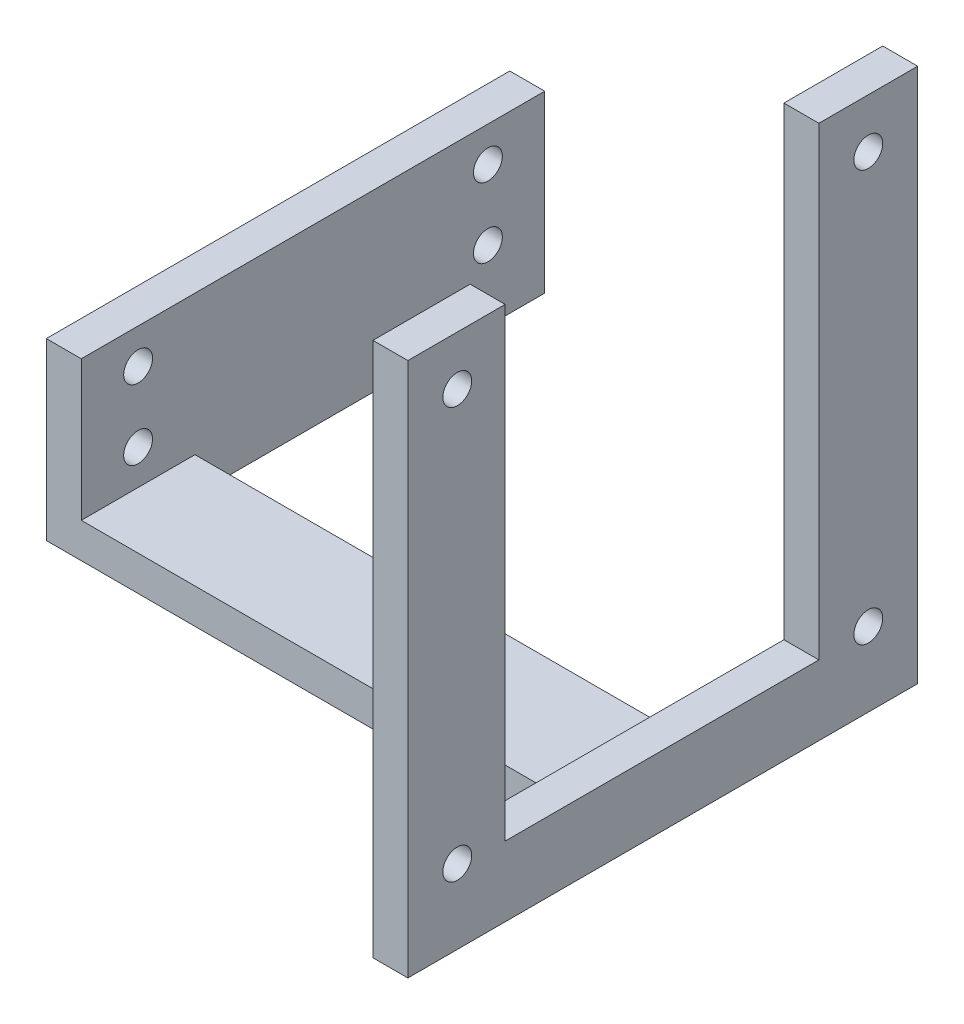
ISO-10303-21;
HEADER;
FILE_DESCRIPTION(('STEP AP214'),'2;1');
FILE_NAME('part.step','',(''),(''),'','','');
FILE_SCHEMA(('AUTOMOTIVE_DESIGN { 1 0 10303 214 1 1 1 1 }'));
ENDSEC;
DATA;
#1=APPLICATION_CONTEXT('core data for automotive mechanical design processes');
#2=APPLICATION_PROTOCOL_DEFINITION('international standard','automotive_design',2000,#1);
#3=PRODUCT_CONTEXT('',#1,'mechanical');
#4=PRODUCT('Part','Part','',(#3));
#5=PRODUCT_RELATED_PRODUCT_CATEGORY('part','',(#4));
#6=PRODUCT_DEFINITION_FORMATION('','',#4);
#7=PRODUCT_DEFINITION_CONTEXT('part definition',#1,'design');
#8=PRODUCT_DEFINITION('design','',#6,#7);
#9=PRODUCT_DEFINITION_SHAPE('','',#8);
#10=(LENGTH_UNIT() NAMED_UNIT(*) SI_UNIT(.MILLI.,.METRE.));
#11=(NAMED_UNIT(*) PLANE_ANGLE_UNIT() SI_UNIT($,.RADIAN.));
#12=(NAMED_UNIT(*) SI_UNIT($,.STERADIAN.) SOLID_ANGLE_UNIT());
#13=UNCERTAINTY_MEASURE_WITH_UNIT(LENGTH_MEASURE(1.E-05),#10,'distance_accuracy_value','');
#14=(GEOMETRIC_REPRESENTATION_CONTEXT(3) GLOBAL_UNCERTAINTY_ASSIGNED_CONTEXT((#13)) GLOBAL_UNIT_ASSIGNED_CONTEXT((#10,
#11,#12)) REPRESENTATION_CONTEXT('',''));
#15=CARTESIAN_POINT('',(0.,0.,0.));
#16=DIRECTION('',(0.,0.,1.));
#17=DIRECTION('',(1.,0.,0.));
#18=AXIS2_PLACEMENT_3D('',#15,#16,#17);
#19=CARTESIAN_POINT('',(4.,0.,-13.));
#20=DIRECTION('',(0.,0.,1.));
#21=DIRECTION('',(0.,-1.,0.));
#22=AXIS2_PLACEMENT_3D('',#19,#20,#21);
#23=PLANE('',#22);
#24=DIRECTION('',(0.,-1.,0.));
#25=VECTOR('',#24,1.);
#26=CARTESIAN_POINT('',(4.,-20.,-13.));
#27=LINE('',#26,#25);
#28=CARTESIAN_POINT('',(4.,-16.,-13.));
#29=VERTEX_POINT('',#28);
#30=CARTESIAN_POINT('',(4.,-20.,-13.));
#31=VERTEX_POINT('',#30);
#32=EDGE_CURVE('E165',#29,#31,#27,.T.);
#33=ORIENTED_EDGE('',*,*,#32,.F.);
#34=DIRECTION('',(-1.,0.,0.));
#35=VECTOR('',#34,1.);
#36=CARTESIAN_POINT('',(64.,-16.,-13.));
#37=LINE('',#36,#35);
#38=CARTESIAN_POINT('',(60.,-16.,-13.));
#39=VERTEX_POINT('',#38);
#40=EDGE_CURVE('E266',#39,#29,#37,.T.);
#41=ORIENTED_EDGE('',*,*,#40,.F.);
#42=DIRECTION('',(0.,1.,0.));
#43=VECTOR('',#42,1.);
#44=CARTESIAN_POINT('',(60.,0.,-13.));
#45=LINE('',#44,#43);
#46=CARTESIAN_POINT('',(60.,-20.,-13.));
#47=VERTEX_POINT('',#46);
#48=EDGE_CURVE('E183',#47,#39,#45,.T.);
#49=ORIENTED_EDGE('',*,*,#48,.F.);
#50=DIRECTION('',(1.,0.,0.));
#51=VECTOR('',#50,1.);
#52=CARTESIAN_POINT('',(4.,-20.,-13.));
#53=LINE('',#52,#51);
#54=EDGE_CURVE('E273',#31,#47,#53,.T.);
#55=ORIENTED_EDGE('',*,*,#54,.F.);
#56=EDGE_LOOP('',(#33,#41,#49,#55));
#57=FACE_BOUND('',#56,.T.);
#58=ADVANCED_FACE('F35',(#57),#23,.F.);
#59=CARTESIAN_POINT('',(4.,0.,0.));
#60=DIRECTION('',(0.,0.,-1.));
#61=DIRECTION('',(0.,1.,0.));
#62=AXIS2_PLACEMENT_3D('',#59,#60,#61);
#63=PLANE('',#62);
#64=DIRECTION('',(0.,-1.,0.));
#65=VECTOR('',#64,1.);
#66=CARTESIAN_POINT('',(60.,0.,0.));
#67=LINE('',#66,#65);
#68=CARTESIAN_POINT('',(60.,-16.,0.));
#69=VERTEX_POINT('',#68);
#70=CARTESIAN_POINT('',(60.,-20.,0.));
#71=VERTEX_POINT('',#70);
#72=EDGE_CURVE('E187',#69,#71,#67,.T.);
#73=ORIENTED_EDGE('',*,*,#72,.F.);
#74=DIRECTION('',(-1.,0.,0.));
#75=VECTOR('',#74,1.);
#76=CARTESIAN_POINT('',(64.,-16.,0.));
#77=LINE('',#76,#75);
#78=CARTESIAN_POINT('',(4.,-16.,0.));
#79=VERTEX_POINT('',#78);
#80=EDGE_CURVE('E262',#69,#79,#77,.T.);
#81=ORIENTED_EDGE('',*,*,#80,.T.);
#82=DIRECTION('',(0.,-1.,0.));
#83=VECTOR('',#82,1.);
#84=CARTESIAN_POINT('',(4.,0.,0.));
#85=LINE('',#84,#83);
#86=CARTESIAN_POINT('',(4.,0.,0.));
#87=VERTEX_POINT('',#86);
#88=EDGE_CURVE('E154',#87,#79,#85,.T.);
#89=ORIENTED_EDGE('',*,*,#88,.F.);
#90=DIRECTION('',(-1.,0.,0.));
#91=VECTOR('',#90,1.);
#92=CARTESIAN_POINT('',(4.,0.,0.));
#93=LINE('',#92,#91);
#94=CARTESIAN_POINT('',(0.,0.,0.));
#95=VERTEX_POINT('',#94);
#96=EDGE_CURVE('E11',#87,#95,#93,.T.);
#97=ORIENTED_EDGE('',*,*,#96,.T.);
#98=DIRECTION('',(0.,-1.,0.));
#99=VECTOR('',#98,1.);
#100=CARTESIAN_POINT('',(0.,0.,0.));
#101=LINE('',#100,#99);
#102=CARTESIAN_POINT('',(0.,-20.,0.));
#103=VERTEX_POINT('',#102);
#104=EDGE_CURVE('E152',#95,#103,#101,.T.);
#105=ORIENTED_EDGE('',*,*,#104,.T.);
#106=DIRECTION('',(-1.,0.,0.));
#107=VECTOR('',#106,1.);
#108=CARTESIAN_POINT('',(4.,-20.,0.));
#109=LINE('',#108,#107);
#110=EDGE_CURVE('E269',#71,#103,#109,.T.);
#111=ORIENTED_EDGE('',*,*,#110,.F.);
#112=EDGE_LOOP('',(#73,#81,#89,#97,#105,#111));
#113=FACE_BOUND('',#112,.T.);
#114=ADVANCED_FACE('F37',(#113),#63,.F.);
#115=CARTESIAN_POINT('',(64.,-16.,0.));
#116=DIRECTION('',(0.,-1.,0.));
#117=DIRECTION('',(0.,0.,-1.));
#118=AXIS2_PLACEMENT_3D('',#115,#116,#117);
#119=PLANE('',#118);
#120=DIRECTION('',(0.,0.,1.));
#121=VECTOR('',#120,1.);
#122=CARTESIAN_POINT('',(60.,-16.,0.));
#123=LINE('',#122,#121);
#124=EDGE_CURVE('E256',#39,#69,#123,.T.);
#125=ORIENTED_EDGE('',*,*,#124,.F.);
#126=ORIENTED_EDGE('',*,*,#40,.T.);
#127=DIRECTION('',(0.,0.,1.));
#128=VECTOR('',#127,1.);
#129=CARTESIAN_POINT('',(4.,-16.,0.));
#130=LINE('',#129,#128);
#131=EDGE_CURVE('E259',#29,#79,#130,.T.);
#132=ORIENTED_EDGE('',*,*,#131,.T.);
#133=ORIENTED_EDGE('',*,*,#80,.F.);
#134=EDGE_LOOP('',(#125,#126,#132,#133));
#135=FACE_BOUND('',#134,.T.);
#136=ADVANCED_FACE('F321',(#135),#119,.F.);
#137=CARTESIAN_POINT('',(4.,0.,0.));
#138=DIRECTION('',(0.,-1.,0.));
#139=DIRECTION('',(0.,0.,-1.));
#140=AXIS2_PLACEMENT_3D('',#137,#138,#139);
#141=PLANE('',#140);
#142=DIRECTION('',(0.,0.,1.));
#143=VECTOR('',#142,1.);
#144=CARTESIAN_POINT('',(0.,0.,0.));
#145=LINE('',#144,#143);
#146=CARTESIAN_POINT('',(0.,0.,-53.));
#147=VERTEX_POINT('',#146);
#148=EDGE_CURVE('E145',#147,#95,#145,.T.);
#149=ORIENTED_EDGE('',*,*,#148,.T.);
#150=ORIENTED_EDGE('',*,*,#96,.F.);
#151=DIRECTION('',(0.,0.,1.));
#152=VECTOR('',#151,1.);
#153=CARTESIAN_POINT('',(4.,0.,0.));
#154=LINE('',#153,#152);
#155=CARTESIAN_POINT('',(4.,0.,-53.));
#156=VERTEX_POINT('',#155);
#157=EDGE_CURVE('E44',#156,#87,#154,.T.);
#158=ORIENTED_EDGE('',*,*,#157,.F.);
#159=DIRECTION('',(1.,0.,0.));
#160=VECTOR('',#159,1.);
#161=CARTESIAN_POINT('',(0.,0.,-53.));
#162=LINE('',#161,#160);
#163=EDGE_CURVE('E157',#147,#156,#162,.T.);
#164=ORIENTED_EDGE('',*,*,#163,.F.);
#165=EDGE_LOOP('',(#149,#150,#158,#164));
#166=FACE_BOUND('',#165,.T.);
#167=ADVANCED_FACE('F158',(#166),#141,.F.);
#168=CARTESIAN_POINT('',(4.,0.,0.));
#169=DIRECTION('',(1.,0.,0.));
#170=DIRECTION('',(0.,0.,-1.));
#171=AXIS2_PLACEMENT_3D('',#168,#169,#170);
#172=PLANE('',#171);
#173=CARTESIAN_POINT('',(4.,-12.,-46.5));
#174=DIRECTION('',(1.,0.,0.));
#175=DIRECTION('',(0.,0.,-1.));
#176=AXIS2_PLACEMENT_3D('',#173,#174,#175);
#177=CIRCLE('',#176,1.65);
#178=CARTESIAN_POINT('',(4.,-12.,-48.15));
#179=VERTEX_POINT('',#178);
#180=EDGE_CURVE('E701',#179,#179,#177,.T.);
#181=ORIENTED_EDGE('',*,*,#180,.F.);
#182=EDGE_LOOP('',(#181));
#183=FACE_BOUND('',#182,.T.);
#184=CARTESIAN_POINT('',(4.,-4.,-46.5));
#185=DIRECTION('',(1.,0.,0.));
#186=DIRECTION('',(0.,0.,-1.));
#187=AXIS2_PLACEMENT_3D('',#184,#185,#186);
#188=CIRCLE('',#187,1.65);
#189=CARTESIAN_POINT('',(4.,-4.,-48.15));
#190=VERTEX_POINT('',#189);
#191=EDGE_CURVE('E167',#190,#190,#188,.T.);
#192=ORIENTED_EDGE('',*,*,#191,.F.);
#193=EDGE_LOOP('',(#192));
#194=FACE_BOUND('',#193,.T.);
#195=ORIENTED_EDGE('',*,*,#131,.F.);
#196=ORIENTED_EDGE('',*,*,#32,.T.);
#197=DIRECTION('',(0.,0.,1.));
#198=VECTOR('',#197,1.);
#199=CARTESIAN_POINT('',(4.,-20.,-53.));
#200=LINE('',#199,#198);
#201=CARTESIAN_POINT('',(4.,-20.,-53.));
#202=VERTEX_POINT('',#201);
#203=EDGE_CURVE('E52',#202,#31,#200,.T.);
#204=ORIENTED_EDGE('',*,*,#203,.F.);
#205=DIRECTION('',(0.,-1.,0.));
#206=VECTOR('',#205,1.);
#207=CARTESIAN_POINT('',(4.,-20.,-53.));
#208=LINE('',#207,#206);
#209=EDGE_CURVE('E160',#156,#202,#208,.T.);
#210=ORIENTED_EDGE('',*,*,#209,.F.);
#211=ORIENTED_EDGE('',*,*,#157,.T.);
#212=ORIENTED_EDGE('',*,*,#88,.T.);
#213=EDGE_LOOP('',(#195,#196,#204,#210,#211,#212));
#214=FACE_BOUND('',#213,.T.);
#215=CARTESIAN_POINT('',(4.,-12.,-6.5));
#216=DIRECTION('',(1.,0.,0.));
#217=DIRECTION('',(0.,0.,-1.));
#218=AXIS2_PLACEMENT_3D('',#215,#216,#217);
#219=CIRCLE('',#218,1.65);
#220=CARTESIAN_POINT('',(4.,-12.,-8.15));
#221=VERTEX_POINT('',#220);
#222=EDGE_CURVE('E275',#221,#221,#219,.T.);
#223=ORIENTED_EDGE('',*,*,#222,.F.);
#224=EDGE_LOOP('',(#223));
#225=FACE_BOUND('',#224,.T.);
#226=CARTESIAN_POINT('',(4.,-4.,-6.5));
#227=DIRECTION('',(1.,0.,0.));
#228=DIRECTION('',(0.,0.,-1.));
#229=AXIS2_PLACEMENT_3D('',#226,#227,#228);
#230=CIRCLE('',#229,1.65);
#231=CARTESIAN_POINT('',(4.,-4.,-8.15));
#232=VERTEX_POINT('',#231);
#233=EDGE_CURVE('E279',#232,#232,#230,.T.);
#234=ORIENTED_EDGE('',*,*,#233,.F.);
#235=EDGE_LOOP('',(#234));
#236=FACE_BOUND('',#235,.T.);
#237=ADVANCED_FACE('F326',(#183,#194,#214,#225,#236),#172,.T.);
#238=CARTESIAN_POINT('',(0.,0.,0.));
#239=DIRECTION('',(1.,0.,0.));
#240=DIRECTION('',(0.,0.,-1.));
#241=AXIS2_PLACEMENT_3D('',#238,#239,#240);
#242=PLANE('',#241);
#243=CARTESIAN_POINT('',(0.,-12.,-46.5));
#244=DIRECTION('',(-1.,0.,0.));
#245=DIRECTION('',(0.,0.,1.));
#246=AXIS2_PLACEMENT_3D('',#243,#244,#245);
#247=CIRCLE('',#246,1.65);
#248=CARTESIAN_POINT('',(0.,-12.,-44.85));
#249=VERTEX_POINT('',#248);
#250=EDGE_CURVE('E704',#249,#249,#247,.T.);
#251=ORIENTED_EDGE('',*,*,#250,.F.);
#252=EDGE_LOOP('',(#251));
#253=FACE_BOUND('',#252,.T.);
#254=CARTESIAN_POINT('',(0.,-4.,-46.5));
#255=DIRECTION('',(-1.,0.,0.));
#256=DIRECTION('',(0.,0.,1.));
#257=AXIS2_PLACEMENT_3D('',#254,#255,#256);
#258=CIRCLE('',#257,1.65);
#259=CARTESIAN_POINT('',(0.,-4.,-44.85));
#260=VERTEX_POINT('',#259);
#261=EDGE_CURVE('E706',#260,#260,#258,.T.);
#262=ORIENTED_EDGE('',*,*,#261,.F.);
#263=EDGE_LOOP('',(#262));
#264=FACE_BOUND('',#263,.T.);
#265=CARTESIAN_POINT('',(0.,-12.,-6.5));
#266=DIRECTION('',(1.,0.,0.));
#267=DIRECTION('',(0.,0.,-1.));
#268=AXIS2_PLACEMENT_3D('',#265,#266,#267);
#269=CIRCLE('',#268,1.65);
#270=CARTESIAN_POINT('',(0.,-12.,-8.15));
#271=VERTEX_POINT('',#270);
#272=EDGE_CURVE('E278',#271,#271,#269,.T.);
#273=ORIENTED_EDGE('',*,*,#272,.T.);
#274=EDGE_LOOP('',(#273));
#275=FACE_BOUND('',#274,.T.);
#276=CARTESIAN_POINT('',(0.,-4.,-6.5));
#277=DIRECTION('',(1.,0.,0.));
#278=DIRECTION('',(0.,0.,-1.));
#279=AXIS2_PLACEMENT_3D('',#276,#277,#278);
#280=CIRCLE('',#279,1.65);
#281=CARTESIAN_POINT('',(0.,-4.,-8.15));
#282=VERTEX_POINT('',#281);
#283=EDGE_CURVE('E282',#282,#282,#280,.T.);
#284=ORIENTED_EDGE('',*,*,#283,.T.);
#285=EDGE_LOOP('',(#284));
#286=FACE_BOUND('',#285,.T.);
#287=ORIENTED_EDGE('',*,*,#104,.F.);
#288=ORIENTED_EDGE('',*,*,#148,.F.);
#289=DIRECTION('',(0.,1.,0.));
#290=VECTOR('',#289,1.);
#291=CARTESIAN_POINT('',(0.,-20.,-53.));
#292=LINE('',#291,#290);
#293=CARTESIAN_POINT('',(0.,-20.,-53.));
#294=VERTEX_POINT('',#293);
#295=EDGE_CURVE('E150',#294,#147,#292,.T.);
#296=ORIENTED_EDGE('',*,*,#295,.F.);
#297=DIRECTION('',(0.,0.,-1.));
#298=VECTOR('',#297,1.);
#299=CARTESIAN_POINT('',(0.,-20.,0.));
#300=LINE('',#299,#298);
#301=EDGE_CURVE('E271',#103,#294,#300,.T.);
#302=ORIENTED_EDGE('',*,*,#301,.F.);
#303=EDGE_LOOP('',(#287,#288,#296,#302));
#304=FACE_BOUND('',#303,.T.);
#305=ADVANCED_FACE('F147',(#253,#264,#275,#286,#304),#242,.F.);
#306=CARTESIAN_POINT('',(-6.,-4.,-6.5));
#307=DIRECTION('',(1.,0.,0.));
#308=DIRECTION('',(0.,0.,-1.));
#309=AXIS2_PLACEMENT_3D('',#306,#307,#308);
#310=CYLINDRICAL_SURFACE('',#309,1.65);
#311=ORIENTED_EDGE('',*,*,#233,.T.);
#312=EDGE_LOOP('',(#311));
#313=FACE_BOUND('',#312,.T.);
#314=ORIENTED_EDGE('',*,*,#283,.F.);
#315=EDGE_LOOP('',(#314));
#316=FACE_BOUND('',#315,.T.);
#317=ADVANCED_FACE('F329',(#313,#316),#310,.F.);
#318=CARTESIAN_POINT('',(-6.,-12.,-6.5));
#319=DIRECTION('',(1.,0.,0.));
#320=DIRECTION('',(0.,0.,-1.));
#321=AXIS2_PLACEMENT_3D('',#318,#319,#320);
#322=CYLINDRICAL_SURFACE('',#321,1.65);
#323=ORIENTED_EDGE('',*,*,#222,.T.);
#324=EDGE_LOOP('',(#323));
#325=FACE_BOUND('',#324,.T.);
#326=ORIENTED_EDGE('',*,*,#272,.F.);
#327=EDGE_LOOP('',(#326));
#328=FACE_BOUND('',#327,.T.);
#329=ADVANCED_FACE('F336',(#325,#328),#322,.F.);
#330=CARTESIAN_POINT('',(0.,-20.,0.));
#331=DIRECTION('',(0.,1.,0.));
#332=DIRECTION('',(0.,0.,1.));
#333=AXIS2_PLACEMENT_3D('',#330,#331,#332);
#334=PLANE('',#333);
#335=DIRECTION('',(0.,0.,-1.));
#336=VECTOR('',#335,1.);
#337=CARTESIAN_POINT('',(64.,-20.,0.));
#338=LINE('',#337,#336);
#339=CARTESIAN_POINT('',(64.,-20.,22.65));
#340=VERTEX_POINT('',#339);
#341=CARTESIAN_POINT('',(64.,-20.,-35.65));
#342=VERTEX_POINT('',#341);
#343=EDGE_CURVE('E260',#340,#342,#338,.T.);
#344=ORIENTED_EDGE('',*,*,#343,.F.);
#345=DIRECTION('',(1.,0.,0.));
#346=VECTOR('',#345,1.);
#347=CARTESIAN_POINT('',(60.,-20.,22.65));
#348=LINE('',#347,#346);
#349=CARTESIAN_POINT('',(60.,-20.,22.65));
#350=VERTEX_POINT('',#349);
#351=EDGE_CURVE('E179',#350,#340,#348,.T.);
#352=ORIENTED_EDGE('',*,*,#351,.F.);
#353=DIRECTION('',(0.,0.,-1.));
#354=VECTOR('',#353,1.);
#355=CARTESIAN_POINT('',(60.,-20.,0.));
#356=LINE('',#355,#354);
#357=EDGE_CURVE('E176',#350,#71,#356,.T.);
#358=ORIENTED_EDGE('',*,*,#357,.T.);
#359=ORIENTED_EDGE('',*,*,#110,.T.);
#360=ORIENTED_EDGE('',*,*,#301,.T.);
#361=DIRECTION('',(-1.,0.,0.));
#362=VECTOR('',#361,1.);
#363=CARTESIAN_POINT('',(0.,-20.,-53.));
#364=LINE('',#363,#362);
#365=EDGE_CURVE('E164',#202,#294,#364,.T.);
#366=ORIENTED_EDGE('',*,*,#365,.F.);
#367=ORIENTED_EDGE('',*,*,#203,.T.);
#368=ORIENTED_EDGE('',*,*,#54,.T.);
#369=CARTESIAN_POINT('',(60.,-20.,-35.65));
#370=VERTEX_POINT('',#369);
#371=EDGE_CURVE('E175',#47,#370,#356,.T.);
#372=ORIENTED_EDGE('',*,*,#371,.T.);
#373=DIRECTION('',(1.,0.,0.));
#374=VECTOR('',#373,1.);
#375=CARTESIAN_POINT('',(60.,-20.,-35.65));
#376=LINE('',#375,#374);
#377=EDGE_CURVE('E180',#370,#342,#376,.T.);
#378=ORIENTED_EDGE('',*,*,#377,.T.);
#379=EDGE_LOOP('',(#344,#352,#358,#359,#360,#366,#367,#368,#372,#378));
#380=FACE_BOUND('',#379,.T.);
#381=ADVANCED_FACE('F340',(#380),#334,.F.);
#382=CARTESIAN_POINT('',(64.,0.,0.));
#383=DIRECTION('',(-1.,0.,0.));
#384=DIRECTION('',(0.,0.,1.));
#385=AXIS2_PLACEMENT_3D('',#382,#383,#384);
#386=PLANE('',#385);
#387=DIRECTION('',(0.,1.,0.));
#388=VECTOR('',#387,1.);
#389=CARTESIAN_POINT('',(64.,12.,22.65));
#390=LINE('',#389,#388);
#391=CARTESIAN_POINT('',(64.,41.15,22.65));
#392=VERTEX_POINT('',#391);
#393=EDGE_CURVE('E249',#340,#392,#390,.T.);
#394=ORIENTED_EDGE('',*,*,#393,.F.);
#395=ORIENTED_EDGE('',*,*,#343,.T.);
#396=DIRECTION('',(0.,-1.,0.));
#397=VECTOR('',#396,1.);
#398=CARTESIAN_POINT('',(64.,-16.,-35.65));
#399=LINE('',#398,#397);
#400=CARTESIAN_POINT('',(64.,41.15,-35.65));
#401=VERTEX_POINT('',#400);
#402=EDGE_CURVE('E253',#401,#342,#399,.T.);
#403=ORIENTED_EDGE('',*,*,#402,.F.);
#404=DIRECTION('',(0.,0.,-1.));
#405=VECTOR('',#404,1.);
#406=CARTESIAN_POINT('',(64.,41.15,-24.35));
#407=LINE('',#406,#405);
#408=CARTESIAN_POINT('',(64.,41.15,-24.35));
#409=VERTEX_POINT('',#408);
#410=EDGE_CURVE('E202',#409,#401,#407,.T.);
#411=ORIENTED_EDGE('',*,*,#410,.F.);
#412=DIRECTION('',(0.,1.,0.));
#413=VECTOR('',#412,1.);
#414=CARTESIAN_POINT('',(64.,-12.,-24.35));
#415=LINE('',#414,#413);
#416=CARTESIAN_POINT('',(64.,-12.,-24.35));
#417=VERTEX_POINT('',#416);
#418=EDGE_CURVE('E239',#417,#409,#415,.T.);
#419=ORIENTED_EDGE('',*,*,#418,.F.);
#420=DIRECTION('',(0.,0.,-1.));
#421=VECTOR('',#420,1.);
#422=CARTESIAN_POINT('',(64.,-12.,-24.35));
#423=LINE('',#422,#421);
#424=CARTESIAN_POINT('',(64.,-12.,11.5283993957704));
#425=VERTEX_POINT('',#424);
#426=EDGE_CURVE('E228',#425,#417,#423,.T.);
#427=ORIENTED_EDGE('',*,*,#426,.F.);
#428=DIRECTION('',(0.,1.,0.));
#429=VECTOR('',#428,1.);
#430=CARTESIAN_POINT('',(64.,-12.,11.5283993957704));
#431=LINE('',#430,#429);
#432=CARTESIAN_POINT('',(64.,41.15,11.5283993957704));
#433=VERTEX_POINT('',#432);
#434=EDGE_CURVE('E240',#425,#433,#431,.T.);
#435=ORIENTED_EDGE('',*,*,#434,.T.);
#436=DIRECTION('',(0.,0.,-1.));
#437=VECTOR('',#436,1.);
#438=CARTESIAN_POINT('',(64.,41.15,22.65));
#439=LINE('',#438,#437);
#440=EDGE_CURVE('E214',#392,#433,#439,.T.);
#441=ORIENTED_EDGE('',*,*,#440,.F.);
#442=EDGE_LOOP('',(#394,#395,#403,#411,#419,#427,#435,#441));
#443=FACE_BOUND('',#442,.T.);
#444=CARTESIAN_POINT('',(64.,-11.5,17.));
#445=DIRECTION('',(1.,0.,0.));
#446=DIRECTION('',(0.,0.,-1.));
#447=AXIS2_PLACEMENT_3D('',#444,#445,#446);
#448=CIRCLE('',#447,1.65);
#449=CARTESIAN_POINT('',(64.,-11.5,15.35));
#450=VERTEX_POINT('',#449);
#451=EDGE_CURVE('E224',#450,#450,#448,.T.);
#452=ORIENTED_EDGE('',*,*,#451,.F.);
#453=EDGE_LOOP('',(#452));
#454=FACE_BOUND('',#453,.T.);
#455=CARTESIAN_POINT('',(64.,-11.5,-30.));
#456=DIRECTION('',(1.,0.,0.));
#457=DIRECTION('',(0.,0.,-1.));
#458=AXIS2_PLACEMENT_3D('',#455,#456,#457);
#459=CIRCLE('',#458,1.65);
#460=CARTESIAN_POINT('',(64.,-11.5,-31.65));
#461=VERTEX_POINT('',#460);
#462=EDGE_CURVE('E220',#461,#461,#459,.T.);
#463=ORIENTED_EDGE('',*,*,#462,.F.);
#464=EDGE_LOOP('',(#463));
#465=FACE_BOUND('',#464,.T.);
#466=CARTESIAN_POINT('',(64.,35.5,17.));
#467=DIRECTION('',(1.,0.,0.));
#468=DIRECTION('',(0.,0.,-1.));
#469=AXIS2_PLACEMENT_3D('',#466,#467,#468);
#470=CIRCLE('',#469,1.65);
#471=CARTESIAN_POINT('',(64.,35.5,15.35));
#472=VERTEX_POINT('',#471);
#473=EDGE_CURVE('E192',#472,#472,#470,.T.);
#474=ORIENTED_EDGE('',*,*,#473,.F.);
#475=EDGE_LOOP('',(#474));
#476=FACE_BOUND('',#475,.T.);
#477=CARTESIAN_POINT('',(64.,35.5,-30.));
#478=DIRECTION('',(1.,0.,0.));
#479=DIRECTION('',(0.,0.,-1.));
#480=AXIS2_PLACEMENT_3D('',#477,#478,#479);
#481=CIRCLE('',#480,1.65);
#482=CARTESIAN_POINT('',(64.,35.5,-31.65));
#483=VERTEX_POINT('',#482);
#484=EDGE_CURVE('E189',#483,#483,#481,.T.);
#485=ORIENTED_EDGE('',*,*,#484,.F.);
#486=EDGE_LOOP('',(#485));
#487=FACE_BOUND('',#486,.T.);
#488=ADVANCED_FACE('F344',(#443,#454,#465,#476,#487),#386,.F.);
#489=CARTESIAN_POINT('',(60.,12.,0.));
#490=DIRECTION('',(1.,0.,0.));
#491=DIRECTION('',(0.,0.,-1.));
#492=AXIS2_PLACEMENT_3D('',#489,#490,#491);
#493=PLANE('',#492);
#494=CARTESIAN_POINT('',(60.,35.5,-30.));
#495=DIRECTION('',(1.,0.,0.));
#496=DIRECTION('',(0.,0.,-1.));
#497=AXIS2_PLACEMENT_3D('',#494,#495,#496);
#498=CIRCLE('',#497,1.65);
#499=CARTESIAN_POINT('',(60.,35.5,-31.65));
#500=VERTEX_POINT('',#499);
#501=EDGE_CURVE('E39',#500,#500,#498,.T.);
#502=ORIENTED_EDGE('',*,*,#501,.T.);
#503=EDGE_LOOP('',(#502));
#504=FACE_BOUND('',#503,.T.);
#505=CARTESIAN_POINT('',(60.,35.5,17.));
#506=DIRECTION('',(1.,0.,0.));
#507=DIRECTION('',(0.,0.,-1.));
#508=AXIS2_PLACEMENT_3D('',#505,#506,#507);
#509=CIRCLE('',#508,1.65);
#510=CARTESIAN_POINT('',(60.,35.5,15.35));
#511=VERTEX_POINT('',#510);
#512=EDGE_CURVE('E195',#511,#511,#509,.T.);
#513=ORIENTED_EDGE('',*,*,#512,.T.);
#514=EDGE_LOOP('',(#513));
#515=FACE_BOUND('',#514,.T.);
#516=CARTESIAN_POINT('',(60.,-11.5,-30.));
#517=DIRECTION('',(1.,0.,0.));
#518=DIRECTION('',(0.,0.,-1.));
#519=AXIS2_PLACEMENT_3D('',#516,#517,#518);
#520=CIRCLE('',#519,1.65);
#521=CARTESIAN_POINT('',(60.,-11.5,-31.65));
#522=VERTEX_POINT('',#521);
#523=EDGE_CURVE('E223',#522,#522,#520,.T.);
#524=ORIENTED_EDGE('',*,*,#523,.T.);
#525=EDGE_LOOP('',(#524));
#526=FACE_BOUND('',#525,.T.);
#527=CARTESIAN_POINT('',(60.,-11.5,17.));
#528=DIRECTION('',(1.,0.,0.));
#529=DIRECTION('',(0.,0.,-1.));
#530=AXIS2_PLACEMENT_3D('',#527,#528,#529);
#531=CIRCLE('',#530,1.65);
#532=CARTESIAN_POINT('',(60.,-11.5,15.35));
#533=VERTEX_POINT('',#532);
#534=EDGE_CURVE('E227',#533,#533,#531,.T.);
#535=ORIENTED_EDGE('',*,*,#534,.T.);
#536=EDGE_LOOP('',(#535));
#537=FACE_BOUND('',#536,.T.);
#538=DIRECTION('',(0.,-1.,0.));
#539=VECTOR('',#538,1.);
#540=CARTESIAN_POINT('',(60.,12.,22.65));
#541=LINE('',#540,#539);
#542=CARTESIAN_POINT('',(60.,41.15,22.65));
#543=VERTEX_POINT('',#542);
#544=EDGE_CURVE('E242',#543,#350,#541,.T.);
#545=ORIENTED_EDGE('',*,*,#544,.F.);
#546=DIRECTION('',(0.,0.,1.));
#547=VECTOR('',#546,1.);
#548=CARTESIAN_POINT('',(60.,41.15,22.65));
#549=LINE('',#548,#547);
#550=CARTESIAN_POINT('',(60.,41.15,11.5283993957704));
#551=VERTEX_POINT('',#550);
#552=EDGE_CURVE('E208',#551,#543,#549,.T.);
#553=ORIENTED_EDGE('',*,*,#552,.F.);
#554=DIRECTION('',(0.,1.,0.));
#555=VECTOR('',#554,1.);
#556=CARTESIAN_POINT('',(60.,-12.,11.5283993957704));
#557=LINE('',#556,#555);
#558=CARTESIAN_POINT('',(60.,-12.,11.5283993957704));
#559=VERTEX_POINT('',#558);
#560=EDGE_CURVE('E243',#559,#551,#557,.T.);
#561=ORIENTED_EDGE('',*,*,#560,.F.);
#562=DIRECTION('',(0.,0.,1.));
#563=VECTOR('',#562,1.);
#564=CARTESIAN_POINT('',(60.,-12.,-24.35));
#565=LINE('',#564,#563);
#566=CARTESIAN_POINT('',(60.,-12.,-24.35));
#567=VERTEX_POINT('',#566);
#568=EDGE_CURVE('E234',#567,#559,#565,.T.);
#569=ORIENTED_EDGE('',*,*,#568,.F.);
#570=DIRECTION('',(0.,1.,0.));
#571=VECTOR('',#570,1.);
#572=CARTESIAN_POINT('',(60.,-12.,-24.35));
#573=LINE('',#572,#571);
#574=CARTESIAN_POINT('',(60.,41.15,-24.35));
#575=VERTEX_POINT('',#574);
#576=EDGE_CURVE('E245',#567,#575,#573,.T.);
#577=ORIENTED_EDGE('',*,*,#576,.T.);
#578=DIRECTION('',(0.,0.,1.));
#579=VECTOR('',#578,1.);
#580=CARTESIAN_POINT('',(60.,41.15,-24.35));
#581=LINE('',#580,#579);
#582=CARTESIAN_POINT('',(60.,41.15,-35.65));
#583=VERTEX_POINT('',#582);
#584=EDGE_CURVE('E196',#583,#575,#581,.T.);
#585=ORIENTED_EDGE('',*,*,#584,.F.);
#586=DIRECTION('',(0.,1.,0.));
#587=VECTOR('',#586,1.);
#588=CARTESIAN_POINT('',(60.,-16.,-35.65));
#589=LINE('',#588,#587);
#590=EDGE_CURVE('E251',#370,#583,#589,.T.);
#591=ORIENTED_EDGE('',*,*,#590,.F.);
#592=ORIENTED_EDGE('',*,*,#371,.F.);
#593=ORIENTED_EDGE('',*,*,#48,.T.);
#594=ORIENTED_EDGE('',*,*,#124,.T.);
#595=ORIENTED_EDGE('',*,*,#72,.T.);
#596=ORIENTED_EDGE('',*,*,#357,.F.);
#597=EDGE_LOOP('',(#545,#553,#561,#569,#577,#585,#591,#592,#593,#594,#595,#596));
#598=FACE_BOUND('',#597,.T.);
#599=ADVANCED_FACE('F296',(#504,#515,#526,#537,#598),#493,.F.);
#600=CARTESIAN_POINT('',(0.,0.,-35.65));
#601=DIRECTION('',(0.,0.,-1.));
#602=DIRECTION('',(-1.,0.,0.));
#603=AXIS2_PLACEMENT_3D('',#600,#601,#602);
#604=PLANE('',#603);
#605=ORIENTED_EDGE('',*,*,#590,.T.);
#606=DIRECTION('',(-1.,0.,0.));
#607=VECTOR('',#606,1.);
#608=CARTESIAN_POINT('',(60.,41.15,-35.65));
#609=LINE('',#608,#607);
#610=EDGE_CURVE('E205',#401,#583,#609,.T.);
#611=ORIENTED_EDGE('',*,*,#610,.F.);
#612=ORIENTED_EDGE('',*,*,#402,.T.);
#613=ORIENTED_EDGE('',*,*,#377,.F.);
#614=EDGE_LOOP('',(#605,#611,#612,#613));
#615=FACE_BOUND('',#614,.T.);
#616=ADVANCED_FACE('F352',(#615),#604,.T.);
#617=CARTESIAN_POINT('',(0.,0.,22.65));
#618=DIRECTION('',(0.,0.,1.));
#619=DIRECTION('',(1.,0.,0.));
#620=AXIS2_PLACEMENT_3D('',#617,#618,#619);
#621=PLANE('',#620);
#622=ORIENTED_EDGE('',*,*,#544,.T.);
#623=ORIENTED_EDGE('',*,*,#351,.T.);
#624=ORIENTED_EDGE('',*,*,#393,.T.);
#625=DIRECTION('',(1.,0.,0.));
#626=VECTOR('',#625,1.);
#627=CARTESIAN_POINT('',(60.,41.15,22.65));
#628=LINE('',#627,#626);
#629=EDGE_CURVE('E211',#543,#392,#628,.T.);
#630=ORIENTED_EDGE('',*,*,#629,.F.);
#631=EDGE_LOOP('',(#622,#623,#624,#630));
#632=FACE_BOUND('',#631,.T.);
#633=ADVANCED_FACE('F356',(#632),#621,.T.);
#634=CARTESIAN_POINT('',(64.,-12.,11.5283993957704));
#635=DIRECTION('',(0.,0.,1.));
#636=DIRECTION('',(1.,0.,0.));
#637=AXIS2_PLACEMENT_3D('',#634,#635,#636);
#638=PLANE('',#637);
#639=ORIENTED_EDGE('',*,*,#560,.T.);
#640=DIRECTION('',(-1.,0.,0.));
#641=VECTOR('',#640,1.);
#642=CARTESIAN_POINT('',(60.,41.15,11.5283993957704));
#643=LINE('',#642,#641);
#644=EDGE_CURVE('E217',#433,#551,#643,.T.);
#645=ORIENTED_EDGE('',*,*,#644,.F.);
#646=ORIENTED_EDGE('',*,*,#434,.F.);
#647=DIRECTION('',(1.,0.,0.));
#648=VECTOR('',#647,1.);
#649=CARTESIAN_POINT('',(64.,-12.,11.5283993957704));
#650=LINE('',#649,#648);
#651=EDGE_CURVE('E236',#559,#425,#650,.T.);
#652=ORIENTED_EDGE('',*,*,#651,.F.);
#653=EDGE_LOOP('',(#639,#645,#646,#652));
#654=FACE_BOUND('',#653,.T.);
#655=ADVANCED_FACE('F360',(#654),#638,.F.);
#656=CARTESIAN_POINT('',(64.,-12.,-24.35));
#657=DIRECTION('',(0.,0.,-1.));
#658=DIRECTION('',(-1.,0.,0.));
#659=AXIS2_PLACEMENT_3D('',#656,#657,#658);
#660=PLANE('',#659);
#661=ORIENTED_EDGE('',*,*,#418,.T.);
#662=DIRECTION('',(1.,0.,0.));
#663=VECTOR('',#662,1.);
#664=CARTESIAN_POINT('',(60.,41.15,-24.35));
#665=LINE('',#664,#663);
#666=EDGE_CURVE('E199',#575,#409,#665,.T.);
#667=ORIENTED_EDGE('',*,*,#666,.F.);
#668=ORIENTED_EDGE('',*,*,#576,.F.);
#669=DIRECTION('',(-1.,0.,0.));
#670=VECTOR('',#669,1.);
#671=CARTESIAN_POINT('',(64.,-12.,-24.35));
#672=LINE('',#671,#670);
#673=EDGE_CURVE('E231',#417,#567,#672,.T.);
#674=ORIENTED_EDGE('',*,*,#673,.F.);
#675=EDGE_LOOP('',(#661,#667,#668,#674));
#676=FACE_BOUND('',#675,.T.);
#677=ADVANCED_FACE('F362',(#676),#660,.F.);
#678=CARTESIAN_POINT('',(0.,-12.,0.));
#679=DIRECTION('',(0.,-1.,0.));
#680=DIRECTION('',(0.,0.,-1.));
#681=AXIS2_PLACEMENT_3D('',#678,#679,#680);
#682=PLANE('',#681);
#683=ORIENTED_EDGE('',*,*,#426,.T.);
#684=ORIENTED_EDGE('',*,*,#673,.T.);
#685=ORIENTED_EDGE('',*,*,#568,.T.);
#686=ORIENTED_EDGE('',*,*,#651,.T.);
#687=EDGE_LOOP('',(#683,#684,#685,#686));
#688=FACE_BOUND('',#687,.T.);
#689=ADVANCED_FACE('F365',(#688),#682,.F.);
#690=CARTESIAN_POINT('',(40.,-11.5,17.));
#691=DIRECTION('',(1.,0.,0.));
#692=DIRECTION('',(0.,0.,-1.));
#693=AXIS2_PLACEMENT_3D('',#690,#691,#692);
#694=CYLINDRICAL_SURFACE('',#693,1.65);
#695=ORIENTED_EDGE('',*,*,#451,.T.);
#696=EDGE_LOOP('',(#695));
#697=FACE_BOUND('',#696,.T.);
#698=ORIENTED_EDGE('',*,*,#534,.F.);
#699=EDGE_LOOP('',(#698));
#700=FACE_BOUND('',#699,.T.);
#701=ADVANCED_FACE('F372',(#697,#700),#694,.F.);
#702=CARTESIAN_POINT('',(40.,-11.5,-30.));
#703=DIRECTION('',(1.,0.,0.));
#704=DIRECTION('',(0.,0.,-1.));
#705=AXIS2_PLACEMENT_3D('',#702,#703,#704);
#706=CYLINDRICAL_SURFACE('',#705,1.65);
#707=ORIENTED_EDGE('',*,*,#462,.T.);
#708=EDGE_LOOP('',(#707));
#709=FACE_BOUND('',#708,.T.);
#710=ORIENTED_EDGE('',*,*,#523,.F.);
#711=EDGE_LOOP('',(#710));
#712=FACE_BOUND('',#711,.T.);
#713=ADVANCED_FACE('F376',(#709,#712),#706,.F.);
#714=CARTESIAN_POINT('',(0.,41.15,0.));
#715=DIRECTION('',(0.,-1.,0.));
#716=DIRECTION('',(0.,0.,-1.));
#717=AXIS2_PLACEMENT_3D('',#714,#715,#716);
#718=PLANE('',#717);
#719=ORIENTED_EDGE('',*,*,#552,.T.);
#720=ORIENTED_EDGE('',*,*,#629,.T.);
#721=ORIENTED_EDGE('',*,*,#440,.T.);
#722=ORIENTED_EDGE('',*,*,#644,.T.);
#723=EDGE_LOOP('',(#719,#720,#721,#722));
#724=FACE_BOUND('',#723,.T.);
#725=ADVANCED_FACE('F311',(#724),#718,.F.);
#726=CARTESIAN_POINT('',(0.,41.15,0.));
#727=DIRECTION('',(0.,-1.,0.));
#728=DIRECTION('',(0.,0.,-1.));
#729=AXIS2_PLACEMENT_3D('',#726,#727,#728);
#730=PLANE('',#729);
#731=ORIENTED_EDGE('',*,*,#584,.T.);
#732=ORIENTED_EDGE('',*,*,#666,.T.);
#733=ORIENTED_EDGE('',*,*,#410,.T.);
#734=ORIENTED_EDGE('',*,*,#610,.T.);
#735=EDGE_LOOP('',(#731,#732,#733,#734));
#736=FACE_BOUND('',#735,.T.);
#737=ADVANCED_FACE('F302',(#736),#730,.F.);
#738=CARTESIAN_POINT('',(34.85,35.5,17.));
#739=DIRECTION('',(1.,0.,0.));
#740=DIRECTION('',(0.,0.,-1.));
#741=AXIS2_PLACEMENT_3D('',#738,#739,#740);
#742=CYLINDRICAL_SURFACE('',#741,1.65);
#743=ORIENTED_EDGE('',*,*,#473,.T.);
#744=EDGE_LOOP('',(#743));
#745=FACE_BOUND('',#744,.T.);
#746=ORIENTED_EDGE('',*,*,#512,.F.);
#747=EDGE_LOOP('',(#746));
#748=FACE_BOUND('',#747,.T.);
#749=ADVANCED_FACE('F299',(#745,#748),#742,.F.);
#750=CARTESIAN_POINT('',(34.85,35.5,-30.));
#751=DIRECTION('',(1.,0.,0.));
#752=DIRECTION('',(0.,0.,-1.));
#753=AXIS2_PLACEMENT_3D('',#750,#751,#752);
#754=CYLINDRICAL_SURFACE('',#753,1.65);
#755=ORIENTED_EDGE('',*,*,#484,.T.);
#756=EDGE_LOOP('',(#755));
#757=FACE_BOUND('',#756,.T.);
#758=ORIENTED_EDGE('',*,*,#501,.F.);
#759=EDGE_LOOP('',(#758));
#760=FACE_BOUND('',#759,.T.);
#761=ADVANCED_FACE('F301',(#757,#760),#754,.F.);
#762=CARTESIAN_POINT('',(0.,0.,-53.));
#763=DIRECTION('',(0.,0.,-1.));
#764=DIRECTION('',(0.,1.,0.));
#765=AXIS2_PLACEMENT_3D('',#762,#763,#764);
#766=PLANE('',#765);
#767=ORIENTED_EDGE('',*,*,#295,.T.);
#768=ORIENTED_EDGE('',*,*,#163,.T.);
#769=ORIENTED_EDGE('',*,*,#209,.T.);
#770=ORIENTED_EDGE('',*,*,#365,.T.);
#771=EDGE_LOOP('',(#767,#768,#769,#770));
#772=FACE_BOUND('',#771,.T.);
#773=ADVANCED_FACE('F163',(#772),#766,.T.);
#774=CARTESIAN_POINT('',(40.,-4.,-46.5));
#775=DIRECTION('',(-1.,0.,0.));
#776=DIRECTION('',(0.,0.,1.));
#777=AXIS2_PLACEMENT_3D('',#774,#775,#776);
#778=CYLINDRICAL_SURFACE('',#777,1.65);
#779=ORIENTED_EDGE('',*,*,#191,.T.);
#780=EDGE_LOOP('',(#779));
#781=FACE_BOUND('',#780,.T.);
#782=ORIENTED_EDGE('',*,*,#261,.T.);
#783=EDGE_LOOP('',(#782));
#784=FACE_BOUND('',#783,.T.);
#785=ADVANCED_FACE('F657',(#781,#784),#778,.F.);
#786=CARTESIAN_POINT('',(40.,-12.,-46.5));
#787=DIRECTION('',(-1.,0.,0.));
#788=DIRECTION('',(0.,0.,1.));
#789=AXIS2_PLACEMENT_3D('',#786,#787,#788);
#790=CYLINDRICAL_SURFACE('',#789,1.65);
#791=ORIENTED_EDGE('',*,*,#180,.T.);
#792=EDGE_LOOP('',(#791));
#793=FACE_BOUND('',#792,.T.);
#794=ORIENTED_EDGE('',*,*,#250,.T.);
#795=EDGE_LOOP('',(#794));
#796=FACE_BOUND('',#795,.T.);
#797=ADVANCED_FACE('F665',(#793,#796),#790,.F.);
#798=CLOSED_SHELL('',(#58,#114,#136,#167,#237,#305,#317,#329,#381,#488,#599,#616,#633,#655,#677,
#689,#701,#713,#725,#737,#749,#761,#773,#785,#797));
#799=MANIFOLD_SOLID_BREP('B2',#798);
#800=ADVANCED_BREP_SHAPE_REPRESENTATION('',(#18,#799),#14);
#801=SHAPE_DEFINITION_REPRESENTATION(#9,#800);
ENDSEC;
END-ISO-10303-21;
